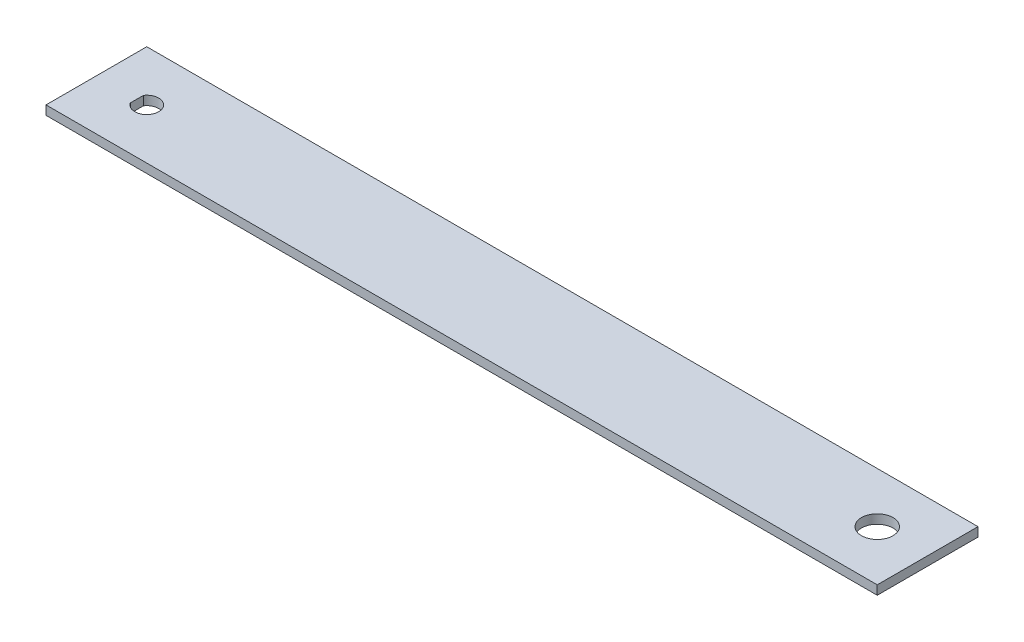
ISO-10303-21;
HEADER;
FILE_DESCRIPTION(('STEP AP214'),'2;1');
FILE_NAME('part.step','',(''),(''),'','','');
FILE_SCHEMA(('AUTOMOTIVE_DESIGN { 1 0 10303 214 1 1 1 1 }'));
ENDSEC;
DATA;
#1=APPLICATION_CONTEXT('core data for automotive mechanical design processes');
#2=APPLICATION_PROTOCOL_DEFINITION('international standard','automotive_design',2000,#1);
#3=PRODUCT_CONTEXT('',#1,'mechanical');
#4=PRODUCT('Part','Part','',(#3));
#5=PRODUCT_RELATED_PRODUCT_CATEGORY('part','',(#4));
#6=PRODUCT_DEFINITION_FORMATION('','',#4);
#7=PRODUCT_DEFINITION_CONTEXT('part definition',#1,'design');
#8=PRODUCT_DEFINITION('design','',#6,#7);
#9=PRODUCT_DEFINITION_SHAPE('','',#8);
#10=(LENGTH_UNIT() NAMED_UNIT(*) SI_UNIT(.MILLI.,.METRE.));
#11=(NAMED_UNIT(*) PLANE_ANGLE_UNIT() SI_UNIT($,.RADIAN.));
#12=(NAMED_UNIT(*) SI_UNIT($,.STERADIAN.) SOLID_ANGLE_UNIT());
#13=UNCERTAINTY_MEASURE_WITH_UNIT(LENGTH_MEASURE(1.E-05),#10,'distance_accuracy_value','');
#14=(GEOMETRIC_REPRESENTATION_CONTEXT(3) GLOBAL_UNCERTAINTY_ASSIGNED_CONTEXT((#13)) GLOBAL_UNIT_ASSIGNED_CONTEXT((#10,
#11,#12)) REPRESENTATION_CONTEXT('',''));
#15=CARTESIAN_POINT('',(0.,0.,0.));
#16=DIRECTION('',(0.,0.,1.));
#17=DIRECTION('',(1.,0.,0.));
#18=AXIS2_PLACEMENT_3D('',#15,#16,#17);
#19=CARTESIAN_POINT('',(0.,2.286,0.));
#20=DIRECTION('',(1.,0.,0.));
#21=DIRECTION('',(0.,0.,-1.));
#22=AXIS2_PLACEMENT_3D('',#19,#20,#21);
#23=PLANE('',#22);
#24=DIRECTION('',(0.,0.,1.));
#25=VECTOR('',#24,1.);
#26=CARTESIAN_POINT('',(0.,0.,0.));
#27=LINE('',#26,#25);
#28=CARTESIAN_POINT('',(0.,0.,-25.4));
#29=VERTEX_POINT('',#28);
#30=CARTESIAN_POINT('',(0.,0.,0.));
#31=VERTEX_POINT('',#30);
#32=EDGE_CURVE('E120',#29,#31,#27,.T.);
#33=ORIENTED_EDGE('',*,*,#32,.T.);
#34=DIRECTION('',(0.,-1.,0.));
#35=VECTOR('',#34,1.);
#36=CARTESIAN_POINT('',(0.,2.286,0.));
#37=LINE('',#36,#35);
#38=CARTESIAN_POINT('',(0.,2.286,0.));
#39=VERTEX_POINT('',#38);
#40=EDGE_CURVE('E11',#39,#31,#37,.T.);
#41=ORIENTED_EDGE('',*,*,#40,.F.);
#42=DIRECTION('',(0.,0.,1.));
#43=VECTOR('',#42,1.);
#44=CARTESIAN_POINT('',(0.,2.286,0.));
#45=LINE('',#44,#43);
#46=CARTESIAN_POINT('',(0.,2.286,-25.4));
#47=VERTEX_POINT('',#46);
#48=EDGE_CURVE('E109',#47,#39,#45,.T.);
#49=ORIENTED_EDGE('',*,*,#48,.F.);
#50=DIRECTION('',(0.,-1.,0.));
#51=VECTOR('',#50,1.);
#52=CARTESIAN_POINT('',(0.,2.286,-25.4));
#53=LINE('',#52,#51);
#54=EDGE_CURVE('E119',#47,#29,#53,.T.);
#55=ORIENTED_EDGE('',*,*,#54,.T.);
#56=EDGE_LOOP('',(#33,#41,#49,#55));
#57=FACE_BOUND('',#56,.T.);
#58=ADVANCED_FACE('F37',(#57),#23,.F.);
#59=CARTESIAN_POINT('',(0.,2.286,0.));
#60=DIRECTION('',(0.,0.,-1.));
#61=DIRECTION('',(-1.,0.,0.));
#62=AXIS2_PLACEMENT_3D('',#59,#60,#61);
#63=PLANE('',#62);
#64=DIRECTION('',(1.,0.,0.));
#65=VECTOR('',#64,1.);
#66=CARTESIAN_POINT('',(0.,0.,0.));
#67=LINE('',#66,#65);
#68=CARTESIAN_POINT('',(209.55,0.,0.));
#69=VERTEX_POINT('',#68);
#70=EDGE_CURVE('E123',#31,#69,#67,.T.);
#71=ORIENTED_EDGE('',*,*,#70,.T.);
#72=DIRECTION('',(0.,-1.,0.));
#73=VECTOR('',#72,1.);
#74=CARTESIAN_POINT('',(209.55,2.286,0.));
#75=LINE('',#74,#73);
#76=CARTESIAN_POINT('',(209.55,2.286,0.));
#77=VERTEX_POINT('',#76);
#78=EDGE_CURVE('E44',#77,#69,#75,.T.);
#79=ORIENTED_EDGE('',*,*,#78,.F.);
#80=DIRECTION('',(1.,0.,0.));
#81=VECTOR('',#80,1.);
#82=CARTESIAN_POINT('',(0.,2.286,0.));
#83=LINE('',#82,#81);
#84=EDGE_CURVE('E112',#39,#77,#83,.T.);
#85=ORIENTED_EDGE('',*,*,#84,.F.);
#86=ORIENTED_EDGE('',*,*,#40,.T.);
#87=EDGE_LOOP('',(#71,#79,#85,#86));
#88=FACE_BOUND('',#87,.T.);
#89=ADVANCED_FACE('F152',(#88),#63,.F.);
#90=CARTESIAN_POINT('',(209.55,2.286,0.));
#91=DIRECTION('',(-1.,0.,0.));
#92=DIRECTION('',(0.,0.,1.));
#93=AXIS2_PLACEMENT_3D('',#90,#91,#92);
#94=PLANE('',#93);
#95=DIRECTION('',(0.,0.,-1.));
#96=VECTOR('',#95,1.);
#97=CARTESIAN_POINT('',(209.55,0.,0.));
#98=LINE('',#97,#96);
#99=CARTESIAN_POINT('',(209.55,0.,-25.4));
#100=VERTEX_POINT('',#99);
#101=EDGE_CURVE('E126',#69,#100,#98,.T.);
#102=ORIENTED_EDGE('',*,*,#101,.T.);
#103=DIRECTION('',(0.,-1.,0.));
#104=VECTOR('',#103,1.);
#105=CARTESIAN_POINT('',(209.55,2.286,-25.4));
#106=LINE('',#105,#104);
#107=CARTESIAN_POINT('',(209.55,2.286,-25.4));
#108=VERTEX_POINT('',#107);
#109=EDGE_CURVE('E131',#108,#100,#106,.T.);
#110=ORIENTED_EDGE('',*,*,#109,.F.);
#111=DIRECTION('',(0.,0.,-1.));
#112=VECTOR('',#111,1.);
#113=CARTESIAN_POINT('',(209.55,2.286,0.));
#114=LINE('',#113,#112);
#115=EDGE_CURVE('E115',#77,#108,#114,.T.);
#116=ORIENTED_EDGE('',*,*,#115,.F.);
#117=ORIENTED_EDGE('',*,*,#78,.T.);
#118=EDGE_LOOP('',(#102,#110,#116,#117));
#119=FACE_BOUND('',#118,.T.);
#120=ADVANCED_FACE('F138',(#119),#94,.F.);
#121=CARTESIAN_POINT('',(0.,2.286,-25.4));
#122=DIRECTION('',(0.,0.,1.));
#123=DIRECTION('',(1.,0.,0.));
#124=AXIS2_PLACEMENT_3D('',#121,#122,#123);
#125=PLANE('',#124);
#126=DIRECTION('',(-1.,0.,0.));
#127=VECTOR('',#126,1.);
#128=CARTESIAN_POINT('',(0.,0.,-25.4));
#129=LINE('',#128,#127);
#130=EDGE_CURVE('E113',#100,#29,#129,.T.);
#131=ORIENTED_EDGE('',*,*,#130,.T.);
#132=ORIENTED_EDGE('',*,*,#54,.F.);
#133=DIRECTION('',(-1.,0.,0.));
#134=VECTOR('',#133,1.);
#135=CARTESIAN_POINT('',(0.,2.286,-25.4));
#136=LINE('',#135,#134);
#137=EDGE_CURVE('E117',#108,#47,#136,.T.);
#138=ORIENTED_EDGE('',*,*,#137,.F.);
#139=ORIENTED_EDGE('',*,*,#109,.T.);
#140=EDGE_LOOP('',(#131,#132,#138,#139));
#141=FACE_BOUND('',#140,.T.);
#142=ADVANCED_FACE('F145',(#141),#125,.F.);
#143=CARTESIAN_POINT('',(0.,2.286,0.));
#144=DIRECTION('',(0.,-1.,0.));
#145=DIRECTION('',(0.,0.,-1.));
#146=AXIS2_PLACEMENT_3D('',#143,#144,#145);
#147=PLANE('',#146);
#148=CARTESIAN_POINT('',(196.85,2.286,-12.7));
#149=DIRECTION('',(0.,1.,0.));
#150=DIRECTION('',(0.,0.,1.));
#151=AXIS2_PLACEMENT_3D('',#148,#149,#150);
#152=CIRCLE('',#151,3.96874999999999);
#153=CARTESIAN_POINT('',(196.85,2.286,-8.73125000000003));
#154=VERTEX_POINT('',#153);
#155=EDGE_CURVE('E104',#154,#154,#152,.T.);
#156=ORIENTED_EDGE('',*,*,#155,.F.);
#157=EDGE_LOOP('',(#156));
#158=FACE_BOUND('',#157,.T.);
#159=DIRECTION('',(0.,0.,1.));
#160=VECTOR('',#159,1.);
#161=CARTESIAN_POINT('',(10.2,2.286,-14.3583123951777));
#162=LINE('',#161,#160);
#163=CARTESIAN_POINT('',(10.2,2.286,-14.3583123951777));
#164=VERTEX_POINT('',#163);
#165=CARTESIAN_POINT('',(10.2,2.286,-11.0416876048223));
#166=VERTEX_POINT('',#165);
#167=EDGE_CURVE('E100',#164,#166,#162,.T.);
#168=ORIENTED_EDGE('',*,*,#167,.F.);
#169=CARTESIAN_POINT('',(12.7,2.286,-12.7));
#170=DIRECTION('',(0.,1.,0.));
#171=DIRECTION('',(0.,0.,1.));
#172=AXIS2_PLACEMENT_3D('',#169,#170,#171);
#173=CIRCLE('',#172,3.);
#174=EDGE_CURVE('E51',#166,#164,#173,.T.);
#175=ORIENTED_EDGE('',*,*,#174,.F.);
#176=EDGE_LOOP('',(#168,#175));
#177=FACE_BOUND('',#176,.T.);
#178=ORIENTED_EDGE('',*,*,#48,.T.);
#179=ORIENTED_EDGE('',*,*,#84,.T.);
#180=ORIENTED_EDGE('',*,*,#115,.T.);
#181=ORIENTED_EDGE('',*,*,#137,.T.);
#182=EDGE_LOOP('',(#178,#179,#180,#181));
#183=FACE_BOUND('',#182,.T.);
#184=ADVANCED_FACE('F151',(#158,#177,#183),#147,.F.);
#185=CARTESIAN_POINT('',(0.,0.,0.));
#186=DIRECTION('',(0.,-1.,0.));
#187=DIRECTION('',(0.,0.,-1.));
#188=AXIS2_PLACEMENT_3D('',#185,#186,#187);
#189=PLANE('',#188);
#190=CARTESIAN_POINT('',(196.85,0.,-12.7));
#191=DIRECTION('',(0.,1.,0.));
#192=DIRECTION('',(0.,0.,1.));
#193=AXIS2_PLACEMENT_3D('',#190,#191,#192);
#194=CIRCLE('',#193,3.96874999999999);
#195=CARTESIAN_POINT('',(196.85,0.,-8.73125000000003));
#196=VERTEX_POINT('',#195);
#197=EDGE_CURVE('E124',#196,#196,#194,.T.);
#198=ORIENTED_EDGE('',*,*,#197,.T.);
#199=EDGE_LOOP('',(#198));
#200=FACE_BOUND('',#199,.T.);
#201=CARTESIAN_POINT('',(12.7,0.,-12.7));
#202=DIRECTION('',(0.,1.,0.));
#203=DIRECTION('',(0.,0.,1.));
#204=AXIS2_PLACEMENT_3D('',#201,#202,#203);
#205=CIRCLE('',#204,3.);
#206=CARTESIAN_POINT('',(10.2,0.,-11.0416876048223));
#207=VERTEX_POINT('',#206);
#208=CARTESIAN_POINT('',(10.2,0.,-14.3583123951777));
#209=VERTEX_POINT('',#208);
#210=EDGE_CURVE('E56',#207,#209,#205,.T.);
#211=ORIENTED_EDGE('',*,*,#210,.T.);
#212=DIRECTION('',(0.,0.,1.));
#213=VECTOR('',#212,1.);
#214=CARTESIAN_POINT('',(10.2,0.,-14.3583123951777));
#215=LINE('',#214,#213);
#216=EDGE_CURVE('E92',#209,#207,#215,.T.);
#217=ORIENTED_EDGE('',*,*,#216,.T.);
#218=EDGE_LOOP('',(#211,#217));
#219=FACE_BOUND('',#218,.T.);
#220=ORIENTED_EDGE('',*,*,#32,.F.);
#221=ORIENTED_EDGE('',*,*,#130,.F.);
#222=ORIENTED_EDGE('',*,*,#101,.F.);
#223=ORIENTED_EDGE('',*,*,#70,.F.);
#224=EDGE_LOOP('',(#220,#221,#222,#223));
#225=FACE_BOUND('',#224,.T.);
#226=ADVANCED_FACE('F98',(#200,#219,#225),#189,.T.);
#227=CARTESIAN_POINT('',(12.7,0.,-12.7));
#228=DIRECTION('',(0.,1.,0.));
#229=DIRECTION('',(0.,0.,1.));
#230=AXIS2_PLACEMENT_3D('',#227,#228,#229);
#231=CYLINDRICAL_SURFACE('',#230,3.);
#232=ORIENTED_EDGE('',*,*,#174,.T.);
#233=DIRECTION('',(0.,1.,0.));
#234=VECTOR('',#233,1.);
#235=CARTESIAN_POINT('',(10.2,0.,-14.3583123951777));
#236=LINE('',#235,#234);
#237=EDGE_CURVE('E85',#209,#164,#236,.T.);
#238=ORIENTED_EDGE('',*,*,#237,.F.);
#239=ORIENTED_EDGE('',*,*,#210,.F.);
#240=DIRECTION('',(0.,1.,0.));
#241=VECTOR('',#240,1.);
#242=CARTESIAN_POINT('',(10.2,0.,-11.0416876048223));
#243=LINE('',#242,#241);
#244=EDGE_CURVE('E91',#207,#166,#243,.T.);
#245=ORIENTED_EDGE('',*,*,#244,.T.);
#246=EDGE_LOOP('',(#232,#238,#239,#245));
#247=FACE_BOUND('',#246,.T.);
#248=ADVANCED_FACE('F87',(#247),#231,.F.);
#249=CARTESIAN_POINT('',(10.2,0.,-14.3583123951777));
#250=DIRECTION('',(-1.,0.,0.));
#251=DIRECTION('',(0.,0.,1.));
#252=AXIS2_PLACEMENT_3D('',#249,#250,#251);
#253=PLANE('',#252);
#254=ORIENTED_EDGE('',*,*,#167,.T.);
#255=ORIENTED_EDGE('',*,*,#244,.F.);
#256=ORIENTED_EDGE('',*,*,#216,.F.);
#257=ORIENTED_EDGE('',*,*,#237,.T.);
#258=EDGE_LOOP('',(#254,#255,#256,#257));
#259=FACE_BOUND('',#258,.T.);
#260=ADVANCED_FACE('F95',(#259),#253,.F.);
#261=CARTESIAN_POINT('',(196.85,0.,-12.7));
#262=DIRECTION('',(0.,1.,0.));
#263=DIRECTION('',(0.,0.,1.));
#264=AXIS2_PLACEMENT_3D('',#261,#262,#263);
#265=CYLINDRICAL_SURFACE('',#264,3.96874999999999);
#266=ORIENTED_EDGE('',*,*,#197,.F.);
#267=EDGE_LOOP('',(#266));
#268=FACE_BOUND('',#267,.T.);
#269=ORIENTED_EDGE('',*,*,#155,.T.);
#270=EDGE_LOOP('',(#269));
#271=FACE_BOUND('',#270,.T.);
#272=ADVANCED_FACE('F172',(#268,#271),#265,.F.);
#273=CLOSED_SHELL('',(#58,#89,#120,#142,#184,#226,#248,#260,#272));
#274=MANIFOLD_SOLID_BREP('B2',#273);
#275=ADVANCED_BREP_SHAPE_REPRESENTATION('',(#18,#274),#14);
#276=SHAPE_DEFINITION_REPRESENTATION(#9,#275);
ENDSEC;
END-ISO-10303-21;
